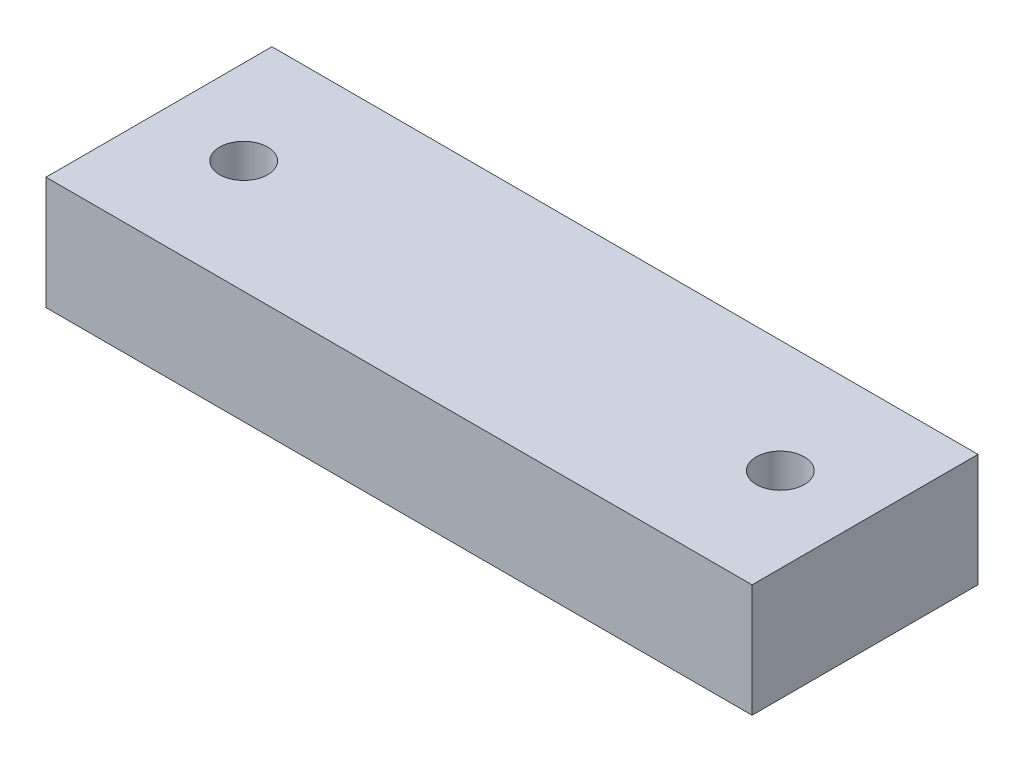
ISO-10303-21;
HEADER;
FILE_DESCRIPTION(('STEP AP214'),'2;1');
FILE_NAME('part.step','',(''),(''),'','','');
FILE_SCHEMA(('AUTOMOTIVE_DESIGN { 1 0 10303 214 1 1 1 1 }'));
ENDSEC;
DATA;
#1=APPLICATION_CONTEXT('core data for automotive mechanical design processes');
#2=APPLICATION_PROTOCOL_DEFINITION('international standard','automotive_design',2000,#1);
#3=PRODUCT_CONTEXT('',#1,'mechanical');
#4=PRODUCT('Part','Part','',(#3));
#5=PRODUCT_RELATED_PRODUCT_CATEGORY('part','',(#4));
#6=PRODUCT_DEFINITION_FORMATION('','',#4);
#7=PRODUCT_DEFINITION_CONTEXT('part definition',#1,'design');
#8=PRODUCT_DEFINITION('design','',#6,#7);
#9=PRODUCT_DEFINITION_SHAPE('','',#8);
#10=(LENGTH_UNIT() NAMED_UNIT(*) SI_UNIT(.MILLI.,.METRE.));
#11=(NAMED_UNIT(*) PLANE_ANGLE_UNIT() SI_UNIT($,.RADIAN.));
#12=(NAMED_UNIT(*) SI_UNIT($,.STERADIAN.) SOLID_ANGLE_UNIT());
#13=UNCERTAINTY_MEASURE_WITH_UNIT(LENGTH_MEASURE(1.E-05),#10,'distance_accuracy_value','');
#14=(GEOMETRIC_REPRESENTATION_CONTEXT(3) GLOBAL_UNCERTAINTY_ASSIGNED_CONTEXT((#13)) GLOBAL_UNIT_ASSIGNED_CONTEXT((#10,
#11,#12)) REPRESENTATION_CONTEXT('',''));
#15=CARTESIAN_POINT('',(0.,0.,0.));
#16=DIRECTION('',(0.,0.,1.));
#17=DIRECTION('',(1.,0.,0.));
#18=AXIS2_PLACEMENT_3D('',#15,#16,#17);
#19=CARTESIAN_POINT('',(62.5,20.,-20.));
#20=DIRECTION('',(-1.,0.,0.));
#21=DIRECTION('',(0.,0.,1.));
#22=AXIS2_PLACEMENT_3D('',#19,#20,#21);
#23=PLANE('',#22);
#24=DIRECTION('',(0.,0.,-1.));
#25=VECTOR('',#24,1.);
#26=CARTESIAN_POINT('',(62.5,0.,-20.));
#27=LINE('',#26,#25);
#28=CARTESIAN_POINT('',(62.5,0.,20.));
#29=VERTEX_POINT('',#28);
#30=CARTESIAN_POINT('',(62.5,0.,-20.));
#31=VERTEX_POINT('',#30);
#32=EDGE_CURVE('E110',#29,#31,#27,.T.);
#33=ORIENTED_EDGE('',*,*,#32,.T.);
#34=DIRECTION('',(0.,-1.,0.));
#35=VECTOR('',#34,1.);
#36=CARTESIAN_POINT('',(62.5,20.,-20.));
#37=LINE('',#36,#35);
#38=CARTESIAN_POINT('',(62.5,20.,-20.));
#39=VERTEX_POINT('',#38);
#40=EDGE_CURVE('E11',#39,#31,#37,.T.);
#41=ORIENTED_EDGE('',*,*,#40,.F.);
#42=DIRECTION('',(0.,0.,-1.));
#43=VECTOR('',#42,1.);
#44=CARTESIAN_POINT('',(62.5,20.,-20.));
#45=LINE('',#44,#43);
#46=CARTESIAN_POINT('',(62.5,20.,20.));
#47=VERTEX_POINT('',#46);
#48=EDGE_CURVE('E94',#47,#39,#45,.T.);
#49=ORIENTED_EDGE('',*,*,#48,.F.);
#50=DIRECTION('',(0.,-1.,0.));
#51=VECTOR('',#50,1.);
#52=CARTESIAN_POINT('',(62.5,20.,20.));
#53=LINE('',#52,#51);
#54=EDGE_CURVE('E106',#47,#29,#53,.T.);
#55=ORIENTED_EDGE('',*,*,#54,.T.);
#56=EDGE_LOOP('',(#33,#41,#49,#55));
#57=FACE_BOUND('',#56,.T.);
#58=ADVANCED_FACE('F42',(#57),#23,.F.);
#59=CARTESIAN_POINT('',(-62.5,20.,-20.));
#60=DIRECTION('',(0.,0.,1.));
#61=DIRECTION('',(1.,0.,0.));
#62=AXIS2_PLACEMENT_3D('',#59,#60,#61);
#63=PLANE('',#62);
#64=DIRECTION('',(-1.,0.,0.));
#65=VECTOR('',#64,1.);
#66=CARTESIAN_POINT('',(-62.5,0.,-20.));
#67=LINE('',#66,#65);
#68=CARTESIAN_POINT('',(-62.5,0.,-20.));
#69=VERTEX_POINT('',#68);
#70=EDGE_CURVE('E99',#31,#69,#67,.T.);
#71=ORIENTED_EDGE('',*,*,#70,.T.);
#72=DIRECTION('',(0.,-1.,0.));
#73=VECTOR('',#72,1.);
#74=CARTESIAN_POINT('',(-62.5,20.,-20.));
#75=LINE('',#74,#73);
#76=CARTESIAN_POINT('',(-62.5,20.,-20.));
#77=VERTEX_POINT('',#76);
#78=EDGE_CURVE('E51',#77,#69,#75,.T.);
#79=ORIENTED_EDGE('',*,*,#78,.F.);
#80=DIRECTION('',(-1.,0.,0.));
#81=VECTOR('',#80,1.);
#82=CARTESIAN_POINT('',(-62.5,20.,-20.));
#83=LINE('',#82,#81);
#84=EDGE_CURVE('E89',#39,#77,#83,.T.);
#85=ORIENTED_EDGE('',*,*,#84,.F.);
#86=ORIENTED_EDGE('',*,*,#40,.T.);
#87=EDGE_LOOP('',(#71,#79,#85,#86));
#88=FACE_BOUND('',#87,.T.);
#89=ADVANCED_FACE('F98',(#88),#63,.F.);
#90=CARTESIAN_POINT('',(-62.5,20.,-20.));
#91=DIRECTION('',(1.,0.,0.));
#92=DIRECTION('',(0.,0.,-1.));
#93=AXIS2_PLACEMENT_3D('',#90,#91,#92);
#94=PLANE('',#93);
#95=DIRECTION('',(0.,0.,1.));
#96=VECTOR('',#95,1.);
#97=CARTESIAN_POINT('',(-62.5,0.,-20.));
#98=LINE('',#97,#96);
#99=CARTESIAN_POINT('',(-62.5,0.,20.));
#100=VERTEX_POINT('',#99);
#101=EDGE_CURVE('E76',#69,#100,#98,.T.);
#102=ORIENTED_EDGE('',*,*,#101,.T.);
#103=DIRECTION('',(0.,-1.,0.));
#104=VECTOR('',#103,1.);
#105=CARTESIAN_POINT('',(-62.5,20.,20.));
#106=LINE('',#105,#104);
#107=CARTESIAN_POINT('',(-62.5,20.,20.));
#108=VERTEX_POINT('',#107);
#109=EDGE_CURVE('E101',#108,#100,#106,.T.);
#110=ORIENTED_EDGE('',*,*,#109,.F.);
#111=DIRECTION('',(0.,0.,1.));
#112=VECTOR('',#111,1.);
#113=CARTESIAN_POINT('',(-62.5,20.,-20.));
#114=LINE('',#113,#112);
#115=EDGE_CURVE('E92',#77,#108,#114,.T.);
#116=ORIENTED_EDGE('',*,*,#115,.F.);
#117=ORIENTED_EDGE('',*,*,#78,.T.);
#118=EDGE_LOOP('',(#102,#110,#116,#117));
#119=FACE_BOUND('',#118,.T.);
#120=ADVANCED_FACE('F102',(#119),#94,.F.);
#121=CARTESIAN_POINT('',(-62.5,20.,20.));
#122=DIRECTION('',(0.,0.,-1.));
#123=DIRECTION('',(-1.,0.,0.));
#124=AXIS2_PLACEMENT_3D('',#121,#122,#123);
#125=PLANE('',#124);
#126=DIRECTION('',(1.,0.,0.));
#127=VECTOR('',#126,1.);
#128=CARTESIAN_POINT('',(-62.5,0.,20.));
#129=LINE('',#128,#127);
#130=EDGE_CURVE('E82',#100,#29,#129,.T.);
#131=ORIENTED_EDGE('',*,*,#130,.T.);
#132=ORIENTED_EDGE('',*,*,#54,.F.);
#133=DIRECTION('',(1.,0.,0.));
#134=VECTOR('',#133,1.);
#135=CARTESIAN_POINT('',(-62.5,20.,20.));
#136=LINE('',#135,#134);
#137=EDGE_CURVE('E59',#108,#47,#136,.T.);
#138=ORIENTED_EDGE('',*,*,#137,.F.);
#139=ORIENTED_EDGE('',*,*,#109,.T.);
#140=EDGE_LOOP('',(#131,#132,#138,#139));
#141=FACE_BOUND('',#140,.T.);
#142=ADVANCED_FACE('F124',(#141),#125,.F.);
#143=CARTESIAN_POINT('',(0.,20.,0.));
#144=DIRECTION('',(0.,1.,0.));
#145=DIRECTION('',(0.,0.,1.));
#146=AXIS2_PLACEMENT_3D('',#143,#144,#145);
#147=PLANE('',#146);
#148=CARTESIAN_POINT('',(47.5,20.,0.));
#149=DIRECTION('',(0.,1.,0.));
#150=DIRECTION('',(0.,0.,1.));
#151=AXIS2_PLACEMENT_3D('',#148,#149,#150);
#152=CIRCLE('',#151,4.25);
#153=CARTESIAN_POINT('',(47.5,20.,4.25000000000001));
#154=VERTEX_POINT('',#153);
#155=EDGE_CURVE('E142',#154,#154,#152,.T.);
#156=ORIENTED_EDGE('',*,*,#155,.F.);
#157=EDGE_LOOP('',(#156));
#158=FACE_BOUND('',#157,.T.);
#159=CARTESIAN_POINT('',(-47.5,20.,0.));
#160=DIRECTION('',(0.,1.,0.));
#161=DIRECTION('',(0.,0.,1.));
#162=AXIS2_PLACEMENT_3D('',#159,#160,#161);
#163=CIRCLE('',#162,4.25);
#164=CARTESIAN_POINT('',(-47.5,20.,4.25000000000002));
#165=VERTEX_POINT('',#164);
#166=EDGE_CURVE('E134',#165,#165,#163,.T.);
#167=ORIENTED_EDGE('',*,*,#166,.F.);
#168=EDGE_LOOP('',(#167));
#169=FACE_BOUND('',#168,.T.);
#170=ORIENTED_EDGE('',*,*,#48,.T.);
#171=ORIENTED_EDGE('',*,*,#84,.T.);
#172=ORIENTED_EDGE('',*,*,#115,.T.);
#173=ORIENTED_EDGE('',*,*,#137,.T.);
#174=EDGE_LOOP('',(#170,#171,#172,#173));
#175=FACE_BOUND('',#174,.T.);
#176=ADVANCED_FACE('F90',(#158,#169,#175),#147,.T.);
#177=CARTESIAN_POINT('',(0.,0.,0.));
#178=DIRECTION('',(0.,1.,0.));
#179=DIRECTION('',(0.,0.,1.));
#180=AXIS2_PLACEMENT_3D('',#177,#178,#179);
#181=PLANE('',#180);
#182=CARTESIAN_POINT('',(47.5,0.,0.));
#183=DIRECTION('',(0.,1.,0.));
#184=DIRECTION('',(0.,0.,1.));
#185=AXIS2_PLACEMENT_3D('',#182,#183,#184);
#186=CIRCLE('',#185,4.25);
#187=CARTESIAN_POINT('',(47.5,0.,4.25000000000001));
#188=VERTEX_POINT('',#187);
#189=EDGE_CURVE('E138',#188,#188,#186,.T.);
#190=ORIENTED_EDGE('',*,*,#189,.T.);
#191=EDGE_LOOP('',(#190));
#192=FACE_BOUND('',#191,.T.);
#193=CARTESIAN_POINT('',(-47.5,0.,0.));
#194=DIRECTION('',(0.,1.,0.));
#195=DIRECTION('',(0.,0.,1.));
#196=AXIS2_PLACEMENT_3D('',#193,#194,#195);
#197=CIRCLE('',#196,4.25);
#198=CARTESIAN_POINT('',(-47.5,0.,4.25000000000002));
#199=VERTEX_POINT('',#198);
#200=EDGE_CURVE('E114',#199,#199,#197,.T.);
#201=ORIENTED_EDGE('',*,*,#200,.T.);
#202=EDGE_LOOP('',(#201));
#203=FACE_BOUND('',#202,.T.);
#204=ORIENTED_EDGE('',*,*,#32,.F.);
#205=ORIENTED_EDGE('',*,*,#130,.F.);
#206=ORIENTED_EDGE('',*,*,#101,.F.);
#207=ORIENTED_EDGE('',*,*,#70,.F.);
#208=EDGE_LOOP('',(#204,#205,#206,#207));
#209=FACE_BOUND('',#208,.T.);
#210=ADVANCED_FACE('F127',(#192,#203,#209),#181,.F.);
#211=CARTESIAN_POINT('',(-47.5,20.,0.));
#212=DIRECTION('',(0.,1.,0.));
#213=DIRECTION('',(0.,0.,1.));
#214=AXIS2_PLACEMENT_3D('',#211,#212,#213);
#215=CYLINDRICAL_SURFACE('',#214,4.25);
#216=ORIENTED_EDGE('',*,*,#166,.T.);
#217=EDGE_LOOP('',(#216));
#218=FACE_BOUND('',#217,.T.);
#219=ORIENTED_EDGE('',*,*,#200,.F.);
#220=EDGE_LOOP('',(#219));
#221=FACE_BOUND('',#220,.T.);
#222=ADVANCED_FACE('F155',(#218,#221),#215,.F.);
#223=CARTESIAN_POINT('',(47.5,20.,0.));
#224=DIRECTION('',(0.,1.,0.));
#225=DIRECTION('',(0.,0.,1.));
#226=AXIS2_PLACEMENT_3D('',#223,#224,#225);
#227=CYLINDRICAL_SURFACE('',#226,4.25);
#228=ORIENTED_EDGE('',*,*,#155,.T.);
#229=EDGE_LOOP('',(#228));
#230=FACE_BOUND('',#229,.T.);
#231=ORIENTED_EDGE('',*,*,#189,.F.);
#232=EDGE_LOOP('',(#231));
#233=FACE_BOUND('',#232,.T.);
#234=ADVANCED_FACE('F147',(#230,#233),#227,.F.);
#235=CLOSED_SHELL('',(#58,#89,#120,#142,#176,#210,#222,#234));
#236=MANIFOLD_SOLID_BREP('B2',#235);
#237=ADVANCED_BREP_SHAPE_REPRESENTATION('',(#18,#236),#14);
#238=SHAPE_DEFINITION_REPRESENTATION(#9,#237);
ENDSEC;
END-ISO-10303-21;
